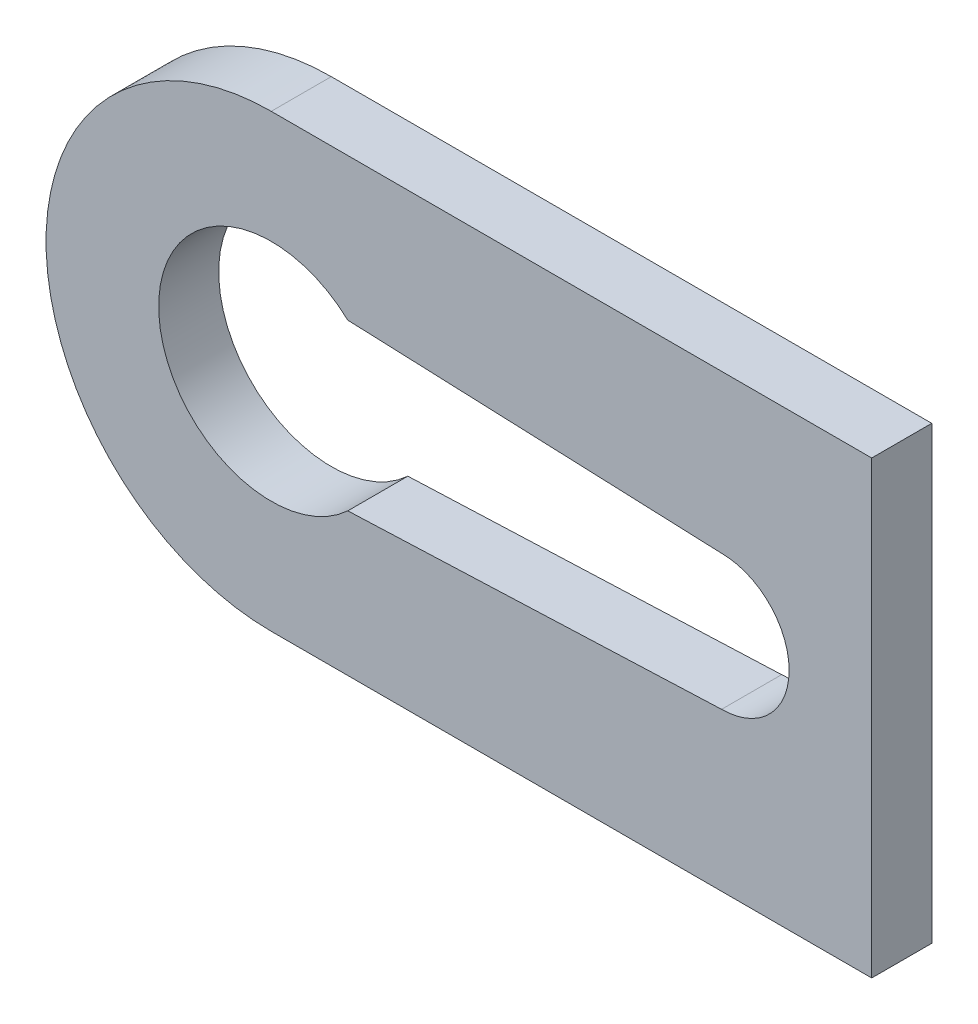
ISO-10303-21;
HEADER;
FILE_DESCRIPTION(('STEP AP214'),'2;1');
FILE_NAME('part.step','',(''),(''),'','','');
FILE_SCHEMA(('AUTOMOTIVE_DESIGN { 1 0 10303 214 1 1 1 1 }'));
ENDSEC;
DATA;
#1=APPLICATION_CONTEXT('core data for automotive mechanical design processes');
#2=APPLICATION_PROTOCOL_DEFINITION('international standard','automotive_design',2000,#1);
#3=PRODUCT_CONTEXT('',#1,'mechanical');
#4=PRODUCT('Part','Part','',(#3));
#5=PRODUCT_RELATED_PRODUCT_CATEGORY('part','',(#4));
#6=PRODUCT_DEFINITION_FORMATION('','',#4);
#7=PRODUCT_DEFINITION_CONTEXT('part definition',#1,'design');
#8=PRODUCT_DEFINITION('design','',#6,#7);
#9=PRODUCT_DEFINITION_SHAPE('','',#8);
#10=(LENGTH_UNIT() NAMED_UNIT(*) SI_UNIT(.MILLI.,.METRE.));
#11=(NAMED_UNIT(*) PLANE_ANGLE_UNIT() SI_UNIT($,.RADIAN.));
#12=(NAMED_UNIT(*) SI_UNIT($,.STERADIAN.) SOLID_ANGLE_UNIT());
#13=UNCERTAINTY_MEASURE_WITH_UNIT(LENGTH_MEASURE(1.E-05),#10,'distance_accuracy_value','');
#14=(GEOMETRIC_REPRESENTATION_CONTEXT(3) GLOBAL_UNCERTAINTY_ASSIGNED_CONTEXT((#13)) GLOBAL_UNIT_ASSIGNED_CONTEXT((#10,
#11,#12)) REPRESENTATION_CONTEXT('',''));
#15=CARTESIAN_POINT('',(0.,0.,0.));
#16=DIRECTION('',(0.,0.,1.));
#17=DIRECTION('',(1.,0.,0.));
#18=AXIS2_PLACEMENT_3D('',#15,#16,#17);
#19=CARTESIAN_POINT('',(0.,7.5,2.));
#20=DIRECTION('',(0.,1.,0.));
#21=DIRECTION('',(-1.,0.,0.));
#22=AXIS2_PLACEMENT_3D('',#19,#20,#21);
#23=PLANE('',#22);
#24=DIRECTION('',(1.,0.,0.));
#25=VECTOR('',#24,1.);
#26=CARTESIAN_POINT('',(0.,7.5,0.));
#27=LINE('',#26,#25);
#28=CARTESIAN_POINT('',(-15.,7.5,0.));
#29=VERTEX_POINT('',#28);
#30=CARTESIAN_POINT('',(5.00000000000001,7.5,0.));
#31=VERTEX_POINT('',#30);
#32=EDGE_CURVE('E151',#29,#31,#27,.T.);
#33=ORIENTED_EDGE('',*,*,#32,.F.);
#34=DIRECTION('',(0.,0.,-1.));
#35=VECTOR('',#34,1.);
#36=CARTESIAN_POINT('',(-15.,7.5,2.));
#37=LINE('',#36,#35);
#38=CARTESIAN_POINT('',(-15.,7.5,2.));
#39=VERTEX_POINT('',#38);
#40=EDGE_CURVE('E11',#39,#29,#37,.T.);
#41=ORIENTED_EDGE('',*,*,#40,.F.);
#42=DIRECTION('',(1.,0.,0.));
#43=VECTOR('',#42,1.);
#44=CARTESIAN_POINT('',(0.,7.5,2.));
#45=LINE('',#44,#43);
#46=CARTESIAN_POINT('',(5.00000000000001,7.5,2.));
#47=VERTEX_POINT('',#46);
#48=EDGE_CURVE('E123',#39,#47,#45,.T.);
#49=ORIENTED_EDGE('',*,*,#48,.T.);
#50=DIRECTION('',(0.,0.,-1.));
#51=VECTOR('',#50,1.);
#52=CARTESIAN_POINT('',(5.00000000000001,7.5,2.));
#53=LINE('',#52,#51);
#54=EDGE_CURVE('E57',#47,#31,#53,.T.);
#55=ORIENTED_EDGE('',*,*,#54,.T.);
#56=EDGE_LOOP('',(#33,#41,#49,#55));
#57=FACE_BOUND('',#56,.T.);
#58=ADVANCED_FACE('F38',(#57),#23,.T.);
#59=CARTESIAN_POINT('',(-15.,0.,2.));
#60=DIRECTION('',(0.,0.,-1.));
#61=DIRECTION('',(-1.,0.,0.));
#62=AXIS2_PLACEMENT_3D('',#59,#60,#61);
#63=CYLINDRICAL_SURFACE('',#62,7.5);
#64=CARTESIAN_POINT('',(-15.,0.,0.));
#65=DIRECTION('',(0.,0.,1.));
#66=DIRECTION('',(1.,0.,0.));
#67=AXIS2_PLACEMENT_3D('',#64,#65,#66);
#68=CIRCLE('',#67,7.5);
#69=CARTESIAN_POINT('',(-15.,-7.5,0.));
#70=VERTEX_POINT('',#69);
#71=EDGE_CURVE('E128',#29,#70,#68,.T.);
#72=ORIENTED_EDGE('',*,*,#71,.T.);
#73=DIRECTION('',(0.,0.,-1.));
#74=VECTOR('',#73,1.);
#75=CARTESIAN_POINT('',(-15.,-7.5,2.));
#76=LINE('',#75,#74);
#77=CARTESIAN_POINT('',(-15.,-7.5,2.));
#78=VERTEX_POINT('',#77);
#79=EDGE_CURVE('E48',#78,#70,#76,.T.);
#80=ORIENTED_EDGE('',*,*,#79,.F.);
#81=CARTESIAN_POINT('',(-15.,0.,2.));
#82=DIRECTION('',(0.,0.,1.));
#83=DIRECTION('',(1.,0.,0.));
#84=AXIS2_PLACEMENT_3D('',#81,#82,#83);
#85=CIRCLE('',#84,7.5);
#86=EDGE_CURVE('E118',#39,#78,#85,.T.);
#87=ORIENTED_EDGE('',*,*,#86,.F.);
#88=ORIENTED_EDGE('',*,*,#40,.T.);
#89=EDGE_LOOP('',(#72,#80,#87,#88));
#90=FACE_BOUND('',#89,.T.);
#91=ADVANCED_FACE('F126',(#90),#63,.T.);
#92=CARTESIAN_POINT('',(0.,-7.5,2.));
#93=DIRECTION('',(0.,1.,0.));
#94=DIRECTION('',(-1.,0.,0.));
#95=AXIS2_PLACEMENT_3D('',#92,#93,#94);
#96=PLANE('',#95);
#97=DIRECTION('',(1.,0.,0.));
#98=VECTOR('',#97,1.);
#99=CARTESIAN_POINT('',(0.,-7.5,0.));
#100=LINE('',#99,#98);
#101=CARTESIAN_POINT('',(5.00000000000001,-7.5,0.));
#102=VERTEX_POINT('',#101);
#103=EDGE_CURVE('E148',#70,#102,#100,.T.);
#104=ORIENTED_EDGE('',*,*,#103,.T.);
#105=DIRECTION('',(0.,0.,-1.));
#106=VECTOR('',#105,1.);
#107=CARTESIAN_POINT('',(5.00000000000001,-7.5,2.));
#108=LINE('',#107,#106);
#109=CARTESIAN_POINT('',(5.00000000000001,-7.5,2.));
#110=VERTEX_POINT('',#109);
#111=EDGE_CURVE('E83',#110,#102,#108,.T.);
#112=ORIENTED_EDGE('',*,*,#111,.F.);
#113=DIRECTION('',(1.,0.,0.));
#114=VECTOR('',#113,1.);
#115=CARTESIAN_POINT('',(0.,-7.5,2.));
#116=LINE('',#115,#114);
#117=EDGE_CURVE('E110',#78,#110,#116,.T.);
#118=ORIENTED_EDGE('',*,*,#117,.F.);
#119=ORIENTED_EDGE('',*,*,#79,.T.);
#120=EDGE_LOOP('',(#104,#112,#118,#119));
#121=FACE_BOUND('',#120,.T.);
#122=ADVANCED_FACE('F112',(#121),#96,.F.);
#123=CARTESIAN_POINT('',(0.,0.,2.));
#124=DIRECTION('',(0.,0.,-1.));
#125=DIRECTION('',(-1.,0.,0.));
#126=AXIS2_PLACEMENT_3D('',#123,#124,#125);
#127=CYLINDRICAL_SURFACE('',#126,2.25);
#128=CARTESIAN_POINT('',(0.,0.,0.));
#129=DIRECTION('',(0.,0.,1.));
#130=DIRECTION('',(1.,0.,0.));
#131=AXIS2_PLACEMENT_3D('',#128,#129,#130);
#132=CIRCLE('',#131,2.25);
#133=CARTESIAN_POINT('',(0.,-2.25,0.));
#134=VERTEX_POINT('',#133);
#135=CARTESIAN_POINT('',(0.,2.25,0.));
#136=VERTEX_POINT('',#135);
#137=EDGE_CURVE('E162',#134,#136,#132,.T.);
#138=ORIENTED_EDGE('',*,*,#137,.F.);
#139=DIRECTION('',(0.,0.,-1.));
#140=VECTOR('',#139,1.);
#141=CARTESIAN_POINT('',(0.,-2.25,2.));
#142=LINE('',#141,#140);
#143=CARTESIAN_POINT('',(0.,-2.25,2.));
#144=VERTEX_POINT('',#143);
#145=EDGE_CURVE('E42',#144,#134,#142,.T.);
#146=ORIENTED_EDGE('',*,*,#145,.F.);
#147=CARTESIAN_POINT('',(0.,0.,2.));
#148=DIRECTION('',(0.,0.,1.));
#149=DIRECTION('',(1.,0.,0.));
#150=AXIS2_PLACEMENT_3D('',#147,#148,#149);
#151=CIRCLE('',#150,2.25);
#152=CARTESIAN_POINT('',(0.,2.25,2.));
#153=VERTEX_POINT('',#152);
#154=EDGE_CURVE('E147',#144,#153,#151,.T.);
#155=ORIENTED_EDGE('',*,*,#154,.T.);
#156=DIRECTION('',(0.,0.,-1.));
#157=VECTOR('',#156,1.);
#158=CARTESIAN_POINT('',(0.,2.25,2.));
#159=LINE('',#158,#157);
#160=EDGE_CURVE('E133',#153,#136,#159,.T.);
#161=ORIENTED_EDGE('',*,*,#160,.T.);
#162=EDGE_LOOP('',(#138,#146,#155,#161));
#163=FACE_BOUND('',#162,.T.);
#164=ADVANCED_FACE('F40',(#163),#127,.F.);
#165=CARTESIAN_POINT('',(0.0902123977015036,-2.24637715479715,2.));
#166=DIRECTION('',(-0.0401267170784004,0.999194598952832,0.));
#167=DIRECTION('',(-0.999194598952832,-0.0401267170784004,0.));
#168=AXIS2_PLACEMENT_3D('',#165,#166,#167);
#169=PLANE('',#168);
#170=DIRECTION('',(0.999194598952832,0.0401267170784004,0.));
#171=VECTOR('',#170,1.);
#172=CARTESIAN_POINT('',(0.0902123977015036,-2.24637715479715,0.));
#173=LINE('',#172,#171);
#174=CARTESIAN_POINT('',(-12.4504902432036,-2.75,0.));
#175=VERTEX_POINT('',#174);
#176=EDGE_CURVE('E159',#175,#134,#173,.T.);
#177=ORIENTED_EDGE('',*,*,#176,.F.);
#178=DIRECTION('',(0.,0.,-1.));
#179=VECTOR('',#178,1.);
#180=CARTESIAN_POINT('',(-12.4504902432036,-2.75,2.));
#181=LINE('',#180,#179);
#182=CARTESIAN_POINT('',(-12.4504902432036,-2.75,2.));
#183=VERTEX_POINT('',#182);
#184=EDGE_CURVE('E136',#183,#175,#181,.T.);
#185=ORIENTED_EDGE('',*,*,#184,.F.);
#186=DIRECTION('',(0.999194598952832,0.0401267170784004,0.));
#187=VECTOR('',#186,1.);
#188=CARTESIAN_POINT('',(0.0902123977015036,-2.24637715479715,2.));
#189=LINE('',#188,#187);
#190=EDGE_CURVE('E171',#183,#144,#189,.T.);
#191=ORIENTED_EDGE('',*,*,#190,.T.);
#192=ORIENTED_EDGE('',*,*,#145,.T.);
#193=EDGE_LOOP('',(#177,#185,#191,#192));
#194=FACE_BOUND('',#193,.T.);
#195=ADVANCED_FACE('F178',(#194),#169,.T.);
#196=CARTESIAN_POINT('',(-15.,0.,2.));
#197=DIRECTION('',(0.,0.,-1.));
#198=DIRECTION('',(-1.,0.,0.));
#199=AXIS2_PLACEMENT_3D('',#196,#197,#198);
#200=CYLINDRICAL_SURFACE('',#199,3.75);
#201=CARTESIAN_POINT('',(-15.,0.,0.));
#202=DIRECTION('',(0.,0.,1.));
#203=DIRECTION('',(1.,0.,0.));
#204=AXIS2_PLACEMENT_3D('',#201,#202,#203);
#205=CIRCLE('',#204,3.75);
#206=CARTESIAN_POINT('',(-12.4504902432036,2.75,0.));
#207=VERTEX_POINT('',#206);
#208=EDGE_CURVE('E156',#207,#175,#205,.T.);
#209=ORIENTED_EDGE('',*,*,#208,.F.);
#210=DIRECTION('',(0.,0.,-1.));
#211=VECTOR('',#210,1.);
#212=CARTESIAN_POINT('',(-12.4504902432036,2.75,2.));
#213=LINE('',#212,#211);
#214=CARTESIAN_POINT('',(-12.4504902432036,2.75,2.));
#215=VERTEX_POINT('',#214);
#216=EDGE_CURVE('E135',#215,#207,#213,.T.);
#217=ORIENTED_EDGE('',*,*,#216,.F.);
#218=CARTESIAN_POINT('',(-15.,0.,2.));
#219=DIRECTION('',(0.,0.,1.));
#220=DIRECTION('',(1.,0.,0.));
#221=AXIS2_PLACEMENT_3D('',#218,#219,#220);
#222=CIRCLE('',#221,3.75);
#223=EDGE_CURVE('E169',#215,#183,#222,.T.);
#224=ORIENTED_EDGE('',*,*,#223,.T.);
#225=ORIENTED_EDGE('',*,*,#184,.T.);
#226=EDGE_LOOP('',(#209,#217,#224,#225));
#227=FACE_BOUND('',#226,.T.);
#228=ADVANCED_FACE('F183',(#227),#200,.F.);
#229=CARTESIAN_POINT('',(0.0902123977015036,2.24637715479715,2.));
#230=DIRECTION('',(0.0401267170784004,0.999194598952832,0.));
#231=DIRECTION('',(-0.999194598952832,0.0401267170784004,0.));
#232=AXIS2_PLACEMENT_3D('',#229,#230,#231);
#233=PLANE('',#232);
#234=DIRECTION('',(0.999194598952832,-0.0401267170784004,0.));
#235=VECTOR('',#234,1.);
#236=CARTESIAN_POINT('',(0.0902123977015036,2.24637715479715,0.));
#237=LINE('',#236,#235);
#238=EDGE_CURVE('E153',#207,#136,#237,.T.);
#239=ORIENTED_EDGE('',*,*,#238,.T.);
#240=ORIENTED_EDGE('',*,*,#160,.F.);
#241=DIRECTION('',(0.999194598952832,-0.0401267170784004,0.));
#242=VECTOR('',#241,1.);
#243=CARTESIAN_POINT('',(0.0902123977015036,2.24637715479715,2.));
#244=LINE('',#243,#242);
#245=EDGE_CURVE('E167',#215,#153,#244,.T.);
#246=ORIENTED_EDGE('',*,*,#245,.F.);
#247=ORIENTED_EDGE('',*,*,#216,.T.);
#248=EDGE_LOOP('',(#239,#240,#246,#247));
#249=FACE_BOUND('',#248,.T.);
#250=ADVANCED_FACE('F185',(#249),#233,.F.);
#251=CARTESIAN_POINT('',(5.00000000000001,0.,2.));
#252=DIRECTION('',(1.,0.,0.));
#253=DIRECTION('',(0.,0.,-1.));
#254=AXIS2_PLACEMENT_3D('',#251,#252,#253);
#255=PLANE('',#254);
#256=DIRECTION('',(0.,-1.,0.));
#257=VECTOR('',#256,1.);
#258=CARTESIAN_POINT('',(5.00000000000001,0.,0.));
#259=LINE('',#258,#257);
#260=EDGE_CURVE('E144',#31,#102,#259,.T.);
#261=ORIENTED_EDGE('',*,*,#260,.F.);
#262=ORIENTED_EDGE('',*,*,#54,.F.);
#263=DIRECTION('',(0.,-1.,0.));
#264=VECTOR('',#263,1.);
#265=CARTESIAN_POINT('',(5.00000000000001,0.,2.));
#266=LINE('',#265,#264);
#267=EDGE_CURVE('E117',#47,#110,#266,.T.);
#268=ORIENTED_EDGE('',*,*,#267,.T.);
#269=ORIENTED_EDGE('',*,*,#111,.T.);
#270=EDGE_LOOP('',(#261,#262,#268,#269));
#271=FACE_BOUND('',#270,.T.);
#272=ADVANCED_FACE('F187',(#271),#255,.T.);
#273=CARTESIAN_POINT('',(0.,0.,2.));
#274=DIRECTION('',(0.,0.,1.));
#275=DIRECTION('',(1.,0.,0.));
#276=AXIS2_PLACEMENT_3D('',#273,#274,#275);
#277=PLANE('',#276);
#278=ORIENTED_EDGE('',*,*,#154,.F.);
#279=ORIENTED_EDGE('',*,*,#190,.F.);
#280=ORIENTED_EDGE('',*,*,#223,.F.);
#281=ORIENTED_EDGE('',*,*,#245,.T.);
#282=EDGE_LOOP('',(#278,#279,#280,#281));
#283=FACE_BOUND('',#282,.T.);
#284=ORIENTED_EDGE('',*,*,#48,.F.);
#285=ORIENTED_EDGE('',*,*,#86,.T.);
#286=ORIENTED_EDGE('',*,*,#117,.T.);
#287=ORIENTED_EDGE('',*,*,#267,.F.);
#288=EDGE_LOOP('',(#284,#285,#286,#287));
#289=FACE_BOUND('',#288,.T.);
#290=ADVANCED_FACE('F122',(#283,#289),#277,.T.);
#291=CARTESIAN_POINT('',(0.,0.,0.));
#292=DIRECTION('',(0.,0.,1.));
#293=DIRECTION('',(1.,0.,0.));
#294=AXIS2_PLACEMENT_3D('',#291,#292,#293);
#295=PLANE('',#294);
#296=ORIENTED_EDGE('',*,*,#137,.T.);
#297=ORIENTED_EDGE('',*,*,#238,.F.);
#298=ORIENTED_EDGE('',*,*,#208,.T.);
#299=ORIENTED_EDGE('',*,*,#176,.T.);
#300=EDGE_LOOP('',(#296,#297,#298,#299));
#301=FACE_BOUND('',#300,.T.);
#302=ORIENTED_EDGE('',*,*,#32,.T.);
#303=ORIENTED_EDGE('',*,*,#260,.T.);
#304=ORIENTED_EDGE('',*,*,#103,.F.);
#305=ORIENTED_EDGE('',*,*,#71,.F.);
#306=EDGE_LOOP('',(#302,#303,#304,#305));
#307=FACE_BOUND('',#306,.T.);
#308=ADVANCED_FACE('F181',(#301,#307),#295,.F.);
#309=CLOSED_SHELL('',(#58,#91,#122,#164,#195,#228,#250,#272,#290,#308));
#310=MANIFOLD_SOLID_BREP('B2',#309);
#311=ADVANCED_BREP_SHAPE_REPRESENTATION('',(#18,#310),#14);
#312=SHAPE_DEFINITION_REPRESENTATION(#9,#311);
ENDSEC;
END-ISO-10303-21;
